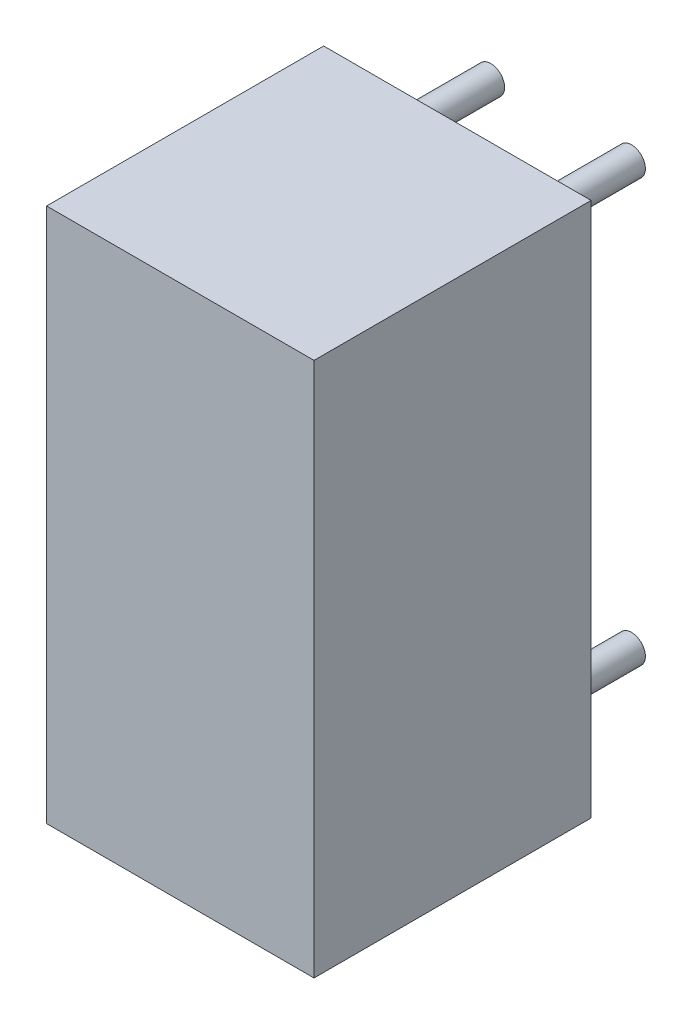
ISO-10303-21;
HEADER;
FILE_DESCRIPTION(('STEP AP214'),'2;1');
FILE_NAME('part.step','',(''),(''),'','','');
FILE_SCHEMA(('AUTOMOTIVE_DESIGN { 1 0 10303 214 1 1 1 1 }'));
ENDSEC;
DATA;
#1=APPLICATION_CONTEXT('core data for automotive mechanical design processes');
#2=APPLICATION_PROTOCOL_DEFINITION('international standard','automotive_design',2000,#1);
#3=PRODUCT_CONTEXT('',#1,'mechanical');
#4=PRODUCT('Part','Part','',(#3));
#5=PRODUCT_RELATED_PRODUCT_CATEGORY('part','',(#4));
#6=PRODUCT_DEFINITION_FORMATION('','',#4);
#7=PRODUCT_DEFINITION_CONTEXT('part definition',#1,'design');
#8=PRODUCT_DEFINITION('design','',#6,#7);
#9=PRODUCT_DEFINITION_SHAPE('','',#8);
#10=(LENGTH_UNIT() NAMED_UNIT(*) SI_UNIT(.MILLI.,.METRE.));
#11=(NAMED_UNIT(*) PLANE_ANGLE_UNIT() SI_UNIT($,.RADIAN.));
#12=(NAMED_UNIT(*) SI_UNIT($,.STERADIAN.) SOLID_ANGLE_UNIT());
#13=UNCERTAINTY_MEASURE_WITH_UNIT(LENGTH_MEASURE(1.E-05),#10,'distance_accuracy_value','');
#14=(GEOMETRIC_REPRESENTATION_CONTEXT(3) GLOBAL_UNCERTAINTY_ASSIGNED_CONTEXT((#13)) GLOBAL_UNIT_ASSIGNED_CONTEXT((#10,
#11,#12)) REPRESENTATION_CONTEXT('',''));
#15=CARTESIAN_POINT('',(0.,0.,0.));
#16=DIRECTION('',(0.,0.,1.));
#17=DIRECTION('',(1.,0.,0.));
#18=AXIS2_PLACEMENT_3D('',#15,#16,#17);
#19=CARTESIAN_POINT('',(0.,7.62,-2.));
#20=DIRECTION('',(0.,0.,1.));
#21=DIRECTION('',(1.,0.,0.));
#22=AXIS2_PLACEMENT_3D('',#19,#20,#21);
#23=CYLINDRICAL_SURFACE('',#22,0.25);
#24=CARTESIAN_POINT('',(0.,7.62,-2.));
#25=DIRECTION('',(0.,0.,1.));
#26=DIRECTION('',(1.,0.,0.));
#27=AXIS2_PLACEMENT_3D('',#24,#25,#26);
#28=CIRCLE('',#27,0.25);
#29=CARTESIAN_POINT('',(0.25,7.62,-2.));
#30=VERTEX_POINT('',#29);
#31=EDGE_CURVE('E11',#30,#30,#28,.T.);
#32=ORIENTED_EDGE('',*,*,#31,.T.);
#33=EDGE_LOOP('',(#32));
#34=FACE_BOUND('',#33,.T.);
#35=CARTESIAN_POINT('',(0.,7.62,0.));
#36=DIRECTION('',(0.,0.,1.));
#37=DIRECTION('',(1.,0.,0.));
#38=AXIS2_PLACEMENT_3D('',#35,#36,#37);
#39=CIRCLE('',#38,0.25);
#40=CARTESIAN_POINT('',(0.25,7.62,0.));
#41=VERTEX_POINT('',#40);
#42=EDGE_CURVE('E43',#41,#41,#39,.T.);
#43=ORIENTED_EDGE('',*,*,#42,.F.);
#44=EDGE_LOOP('',(#43));
#45=FACE_BOUND('',#44,.T.);
#46=ADVANCED_FACE('F40',(#34,#45),#23,.T.);
#47=CARTESIAN_POINT('',(0.,7.62,-2.));
#48=DIRECTION('',(0.,0.,1.));
#49=DIRECTION('',(1.,0.,0.));
#50=AXIS2_PLACEMENT_3D('',#47,#48,#49);
#51=PLANE('',#50);
#52=ORIENTED_EDGE('',*,*,#31,.F.);
#53=EDGE_LOOP('',(#52));
#54=FACE_BOUND('',#53,.T.);
#55=ADVANCED_FACE('F55',(#54),#51,.F.);
#56=CARTESIAN_POINT('',(0.,7.62,0.));
#57=DIRECTION('',(0.,0.,1.));
#58=DIRECTION('',(1.,0.,0.));
#59=AXIS2_PLACEMENT_3D('',#56,#57,#58);
#60=PLANE('',#59);
#61=ORIENTED_EDGE('',*,*,#42,.T.);
#62=EDGE_LOOP('',(#61));
#63=FACE_BOUND('',#62,.T.);
#64=ADVANCED_FACE('F52',(#63),#60,.T.);
#65=CLOSED_SHELL('',(#46,#55,#64));
#66=MANIFOLD_SOLID_BREP('B2',#65);
#67=CARTESIAN_POINT('',(2.54,7.62,-2.));
#68=DIRECTION('',(0.,0.,1.));
#69=DIRECTION('',(1.,0.,0.));
#70=AXIS2_PLACEMENT_3D('',#67,#68,#69);
#71=CYLINDRICAL_SURFACE('',#70,0.25);
#72=CARTESIAN_POINT('',(2.54,7.62,-2.));
#73=DIRECTION('',(0.,0.,1.));
#74=DIRECTION('',(1.,0.,0.));
#75=AXIS2_PLACEMENT_3D('',#72,#73,#74);
#76=CIRCLE('',#75,0.25);
#77=CARTESIAN_POINT('',(2.79,7.62,-2.));
#78=VERTEX_POINT('',#77);
#79=EDGE_CURVE('E39',#78,#78,#76,.T.);
#80=ORIENTED_EDGE('',*,*,#79,.T.);
#81=EDGE_LOOP('',(#80));
#82=FACE_BOUND('',#81,.T.);
#83=CARTESIAN_POINT('',(2.54,7.62,0.));
#84=DIRECTION('',(0.,0.,1.));
#85=DIRECTION('',(1.,0.,0.));
#86=AXIS2_PLACEMENT_3D('',#83,#84,#85);
#87=CIRCLE('',#86,0.25);
#88=CARTESIAN_POINT('',(2.79,7.62,0.));
#89=VERTEX_POINT('',#88);
#90=EDGE_CURVE('E92',#89,#89,#87,.T.);
#91=ORIENTED_EDGE('',*,*,#90,.F.);
#92=EDGE_LOOP('',(#91));
#93=FACE_BOUND('',#92,.T.);
#94=ADVANCED_FACE('F89',(#82,#93),#71,.T.);
#95=CARTESIAN_POINT('',(2.54,7.62,-2.));
#96=DIRECTION('',(0.,0.,1.));
#97=DIRECTION('',(1.,0.,0.));
#98=AXIS2_PLACEMENT_3D('',#95,#96,#97);
#99=PLANE('',#98);
#100=ORIENTED_EDGE('',*,*,#79,.F.);
#101=EDGE_LOOP('',(#100));
#102=FACE_BOUND('',#101,.T.);
#103=ADVANCED_FACE('F104',(#102),#99,.F.);
#104=CARTESIAN_POINT('',(2.54,7.62,0.));
#105=DIRECTION('',(0.,0.,1.));
#106=DIRECTION('',(1.,0.,0.));
#107=AXIS2_PLACEMENT_3D('',#104,#105,#106);
#108=PLANE('',#107);
#109=ORIENTED_EDGE('',*,*,#90,.T.);
#110=EDGE_LOOP('',(#109));
#111=FACE_BOUND('',#110,.T.);
#112=ADVANCED_FACE('F101',(#111),#108,.T.);
#113=CLOSED_SHELL('',(#94,#103,#112));
#114=MANIFOLD_SOLID_BREP('B6',#113);
#115=CARTESIAN_POINT('',(2.54,0.,-2.));
#116=DIRECTION('',(0.,0.,1.));
#117=DIRECTION('',(1.,0.,0.));
#118=AXIS2_PLACEMENT_3D('',#115,#116,#117);
#119=CYLINDRICAL_SURFACE('',#118,0.25);
#120=CARTESIAN_POINT('',(2.54,0.,-2.));
#121=DIRECTION('',(0.,0.,1.));
#122=DIRECTION('',(1.,0.,0.));
#123=AXIS2_PLACEMENT_3D('',#120,#121,#122);
#124=CIRCLE('',#123,0.25);
#125=CARTESIAN_POINT('',(2.79,0.,-2.));
#126=VERTEX_POINT('',#125);
#127=EDGE_CURVE('E88',#126,#126,#124,.T.);
#128=ORIENTED_EDGE('',*,*,#127,.T.);
#129=EDGE_LOOP('',(#128));
#130=FACE_BOUND('',#129,.T.);
#131=CARTESIAN_POINT('',(2.54,0.,0.));
#132=DIRECTION('',(0.,0.,1.));
#133=DIRECTION('',(1.,0.,0.));
#134=AXIS2_PLACEMENT_3D('',#131,#132,#133);
#135=CIRCLE('',#134,0.25);
#136=CARTESIAN_POINT('',(2.79,0.,0.));
#137=VERTEX_POINT('',#136);
#138=EDGE_CURVE('E141',#137,#137,#135,.T.);
#139=ORIENTED_EDGE('',*,*,#138,.F.);
#140=EDGE_LOOP('',(#139));
#141=FACE_BOUND('',#140,.T.);
#142=ADVANCED_FACE('F138',(#130,#141),#119,.T.);
#143=CARTESIAN_POINT('',(2.54,0.,-2.));
#144=DIRECTION('',(0.,0.,1.));
#145=DIRECTION('',(1.,0.,0.));
#146=AXIS2_PLACEMENT_3D('',#143,#144,#145);
#147=PLANE('',#146);
#148=ORIENTED_EDGE('',*,*,#127,.F.);
#149=EDGE_LOOP('',(#148));
#150=FACE_BOUND('',#149,.T.);
#151=ADVANCED_FACE('F153',(#150),#147,.F.);
#152=CARTESIAN_POINT('',(2.54,0.,0.));
#153=DIRECTION('',(0.,0.,1.));
#154=DIRECTION('',(1.,0.,0.));
#155=AXIS2_PLACEMENT_3D('',#152,#153,#154);
#156=PLANE('',#155);
#157=ORIENTED_EDGE('',*,*,#138,.T.);
#158=EDGE_LOOP('',(#157));
#159=FACE_BOUND('',#158,.T.);
#160=ADVANCED_FACE('F150',(#159),#156,.T.);
#161=CLOSED_SHELL('',(#142,#151,#160));
#162=MANIFOLD_SOLID_BREP('B34',#161);
#163=CARTESIAN_POINT('',(0.,0.,-2.));
#164=DIRECTION('',(0.,0.,1.));
#165=DIRECTION('',(1.,0.,0.));
#166=AXIS2_PLACEMENT_3D('',#163,#164,#165);
#167=CYLINDRICAL_SURFACE('',#166,0.25);
#168=CARTESIAN_POINT('',(0.,0.,-2.));
#169=DIRECTION('',(0.,0.,1.));
#170=DIRECTION('',(1.,0.,0.));
#171=AXIS2_PLACEMENT_3D('',#168,#169,#170);
#172=CIRCLE('',#171,0.25);
#173=CARTESIAN_POINT('',(0.25,0.,-2.));
#174=VERTEX_POINT('',#173);
#175=EDGE_CURVE('E137',#174,#174,#172,.T.);
#176=ORIENTED_EDGE('',*,*,#175,.T.);
#177=EDGE_LOOP('',(#176));
#178=FACE_BOUND('',#177,.T.);
#179=CARTESIAN_POINT('',(0.,0.,0.));
#180=DIRECTION('',(0.,0.,1.));
#181=DIRECTION('',(1.,0.,0.));
#182=AXIS2_PLACEMENT_3D('',#179,#180,#181);
#183=CIRCLE('',#182,0.25);
#184=CARTESIAN_POINT('',(0.25,0.,0.));
#185=VERTEX_POINT('',#184);
#186=EDGE_CURVE('E191',#185,#185,#183,.T.);
#187=ORIENTED_EDGE('',*,*,#186,.F.);
#188=EDGE_LOOP('',(#187));
#189=FACE_BOUND('',#188,.T.);
#190=ADVANCED_FACE('F188',(#178,#189),#167,.T.);
#191=CARTESIAN_POINT('',(0.,0.,-2.));
#192=DIRECTION('',(0.,0.,1.));
#193=DIRECTION('',(1.,0.,0.));
#194=AXIS2_PLACEMENT_3D('',#191,#192,#193);
#195=PLANE('',#194);
#196=ORIENTED_EDGE('',*,*,#175,.F.);
#197=EDGE_LOOP('',(#196));
#198=FACE_BOUND('',#197,.T.);
#199=ADVANCED_FACE('F203',(#198),#195,.F.);
#200=CARTESIAN_POINT('',(0.,0.,0.));
#201=DIRECTION('',(0.,0.,1.));
#202=DIRECTION('',(1.,0.,0.));
#203=AXIS2_PLACEMENT_3D('',#200,#201,#202);
#204=PLANE('',#203);
#205=ORIENTED_EDGE('',*,*,#186,.T.);
#206=EDGE_LOOP('',(#205));
#207=FACE_BOUND('',#206,.T.);
#208=ADVANCED_FACE('F200',(#207),#204,.T.);
#209=CLOSED_SHELL('',(#190,#199,#208));
#210=MANIFOLD_SOLID_BREP('B83',#209);
#211=CARTESIAN_POINT('',(3.81,8.636,5.));
#212=DIRECTION('',(0.,-1.,0.));
#213=DIRECTION('',(0.,0.,-1.));
#214=AXIS2_PLACEMENT_3D('',#211,#212,#213);
#215=PLANE('',#214);
#216=DIRECTION('',(-1.,0.,0.));
#217=VECTOR('',#216,1.);
#218=CARTESIAN_POINT('',(3.81,8.636,0.));
#219=LINE('',#218,#217);
#220=CARTESIAN_POINT('',(3.81,8.636,0.));
#221=VERTEX_POINT('',#220);
#222=CARTESIAN_POINT('',(-1.016,8.636,0.));
#223=VERTEX_POINT('',#222);
#224=EDGE_CURVE('E292',#221,#223,#219,.T.);
#225=ORIENTED_EDGE('',*,*,#224,.T.);
#226=DIRECTION('',(0.,0.,-1.));
#227=VECTOR('',#226,1.);
#228=CARTESIAN_POINT('',(-1.016,8.636,5.));
#229=LINE('',#228,#227);
#230=CARTESIAN_POINT('',(-1.016,8.636,5.));
#231=VERTEX_POINT('',#230);
#232=EDGE_CURVE('E186',#231,#223,#229,.T.);
#233=ORIENTED_EDGE('',*,*,#232,.F.);
#234=DIRECTION('',(-1.,0.,0.));
#235=VECTOR('',#234,1.);
#236=CARTESIAN_POINT('',(3.81,8.636,5.));
#237=LINE('',#236,#235);
#238=CARTESIAN_POINT('',(3.81,8.636,5.));
#239=VERTEX_POINT('',#238);
#240=EDGE_CURVE('E280',#239,#231,#237,.T.);
#241=ORIENTED_EDGE('',*,*,#240,.F.);
#242=DIRECTION('',(0.,0.,-1.));
#243=VECTOR('',#242,1.);
#244=CARTESIAN_POINT('',(3.81,8.636,5.));
#245=LINE('',#244,#243);
#246=EDGE_CURVE('E288',#239,#221,#245,.T.);
#247=ORIENTED_EDGE('',*,*,#246,.T.);
#248=EDGE_LOOP('',(#225,#233,#241,#247));
#249=FACE_BOUND('',#248,.T.);
#250=ADVANCED_FACE('F229',(#249),#215,.F.);
#251=CARTESIAN_POINT('',(-1.016,8.636,5.));
#252=DIRECTION('',(1.,0.,0.));
#253=DIRECTION('',(0.,0.,-1.));
#254=AXIS2_PLACEMENT_3D('',#251,#252,#253);
#255=PLANE('',#254);
#256=DIRECTION('',(0.,-1.,0.));
#257=VECTOR('',#256,1.);
#258=CARTESIAN_POINT('',(-1.016,8.636,0.));
#259=LINE('',#258,#257);
#260=CARTESIAN_POINT('',(-1.016,-1.016,0.));
#261=VERTEX_POINT('',#260);
#262=EDGE_CURVE('E284',#223,#261,#259,.T.);
#263=ORIENTED_EDGE('',*,*,#262,.T.);
#264=DIRECTION('',(0.,0.,-1.));
#265=VECTOR('',#264,1.);
#266=CARTESIAN_POINT('',(-1.016,-1.016,5.));
#267=LINE('',#266,#265);
#268=CARTESIAN_POINT('',(-1.016,-1.016,5.));
#269=VERTEX_POINT('',#268);
#270=EDGE_CURVE('E237',#269,#261,#267,.T.);
#271=ORIENTED_EDGE('',*,*,#270,.F.);
#272=DIRECTION('',(0.,-1.,0.));
#273=VECTOR('',#272,1.);
#274=CARTESIAN_POINT('',(-1.016,8.636,5.));
#275=LINE('',#274,#273);
#276=EDGE_CURVE('E275',#231,#269,#275,.T.);
#277=ORIENTED_EDGE('',*,*,#276,.F.);
#278=ORIENTED_EDGE('',*,*,#232,.T.);
#279=EDGE_LOOP('',(#263,#271,#277,#278));
#280=FACE_BOUND('',#279,.T.);
#281=ADVANCED_FACE('F283',(#280),#255,.F.);
#282=CARTESIAN_POINT('',(-1.016,-1.016,5.));
#283=DIRECTION('',(0.,1.,0.));
#284=DIRECTION('',(0.,0.,1.));
#285=AXIS2_PLACEMENT_3D('',#282,#283,#284);
#286=PLANE('',#285);
#287=DIRECTION('',(1.,0.,0.));
#288=VECTOR('',#287,1.);
#289=CARTESIAN_POINT('',(-1.016,-1.016,0.));
#290=LINE('',#289,#288);
#291=CARTESIAN_POINT('',(3.81,-1.016,0.));
#292=VERTEX_POINT('',#291);
#293=EDGE_CURVE('E262',#261,#292,#290,.T.);
#294=ORIENTED_EDGE('',*,*,#293,.T.);
#295=DIRECTION('',(0.,0.,-1.));
#296=VECTOR('',#295,1.);
#297=CARTESIAN_POINT('',(3.81,-1.016,5.));
#298=LINE('',#297,#296);
#299=CARTESIAN_POINT('',(3.81,-1.016,5.));
#300=VERTEX_POINT('',#299);
#301=EDGE_CURVE('E285',#300,#292,#298,.T.);
#302=ORIENTED_EDGE('',*,*,#301,.F.);
#303=DIRECTION('',(1.,0.,0.));
#304=VECTOR('',#303,1.);
#305=CARTESIAN_POINT('',(-1.016,-1.016,5.));
#306=LINE('',#305,#304);
#307=EDGE_CURVE('E278',#269,#300,#306,.T.);
#308=ORIENTED_EDGE('',*,*,#307,.F.);
#309=ORIENTED_EDGE('',*,*,#270,.T.);
#310=EDGE_LOOP('',(#294,#302,#308,#309));
#311=FACE_BOUND('',#310,.T.);
#312=ADVANCED_FACE('F286',(#311),#286,.F.);
#313=CARTESIAN_POINT('',(3.81,-1.016,5.));
#314=DIRECTION('',(-1.,0.,0.));
#315=DIRECTION('',(0.,0.,1.));
#316=AXIS2_PLACEMENT_3D('',#313,#314,#315);
#317=PLANE('',#316);
#318=DIRECTION('',(0.,1.,0.));
#319=VECTOR('',#318,1.);
#320=CARTESIAN_POINT('',(3.81,-1.016,0.));
#321=LINE('',#320,#319);
#322=EDGE_CURVE('E268',#292,#221,#321,.T.);
#323=ORIENTED_EDGE('',*,*,#322,.T.);
#324=ORIENTED_EDGE('',*,*,#246,.F.);
#325=DIRECTION('',(0.,1.,0.));
#326=VECTOR('',#325,1.);
#327=CARTESIAN_POINT('',(3.81,-1.016,5.));
#328=LINE('',#327,#326);
#329=EDGE_CURVE('E245',#300,#239,#328,.T.);
#330=ORIENTED_EDGE('',*,*,#329,.F.);
#331=ORIENTED_EDGE('',*,*,#301,.T.);
#332=EDGE_LOOP('',(#323,#324,#330,#331));
#333=FACE_BOUND('',#332,.T.);
#334=ADVANCED_FACE('F299',(#333),#317,.F.);
#335=CARTESIAN_POINT('',(0.,0.,5.));
#336=DIRECTION('',(0.,0.,1.));
#337=DIRECTION('',(1.,0.,0.));
#338=AXIS2_PLACEMENT_3D('',#335,#336,#337);
#339=PLANE('',#338);
#340=ORIENTED_EDGE('',*,*,#240,.T.);
#341=ORIENTED_EDGE('',*,*,#276,.T.);
#342=ORIENTED_EDGE('',*,*,#307,.T.);
#343=ORIENTED_EDGE('',*,*,#329,.T.);
#344=EDGE_LOOP('',(#340,#341,#342,#343));
#345=FACE_BOUND('',#344,.T.);
#346=ADVANCED_FACE('F276',(#345),#339,.T.);
#347=CARTESIAN_POINT('',(0.,0.,0.));
#348=DIRECTION('',(0.,0.,1.));
#349=DIRECTION('',(1.,0.,0.));
#350=AXIS2_PLACEMENT_3D('',#347,#348,#349);
#351=PLANE('',#350);
#352=ORIENTED_EDGE('',*,*,#224,.F.);
#353=ORIENTED_EDGE('',*,*,#322,.F.);
#354=ORIENTED_EDGE('',*,*,#293,.F.);
#355=ORIENTED_EDGE('',*,*,#262,.F.);
#356=EDGE_LOOP('',(#352,#353,#354,#355));
#357=FACE_BOUND('',#356,.T.);
#358=ADVANCED_FACE('F302',(#357),#351,.F.);
#359=CLOSED_SHELL('',(#250,#281,#312,#334,#346,#358));
#360=MANIFOLD_SOLID_BREP('B132',#359);
#361=ADVANCED_BREP_SHAPE_REPRESENTATION('',(#18,#66,#114,#162,#210,#360),#14);
#362=SHAPE_DEFINITION_REPRESENTATION(#9,#361);
ENDSEC;
END-ISO-10303-21;
